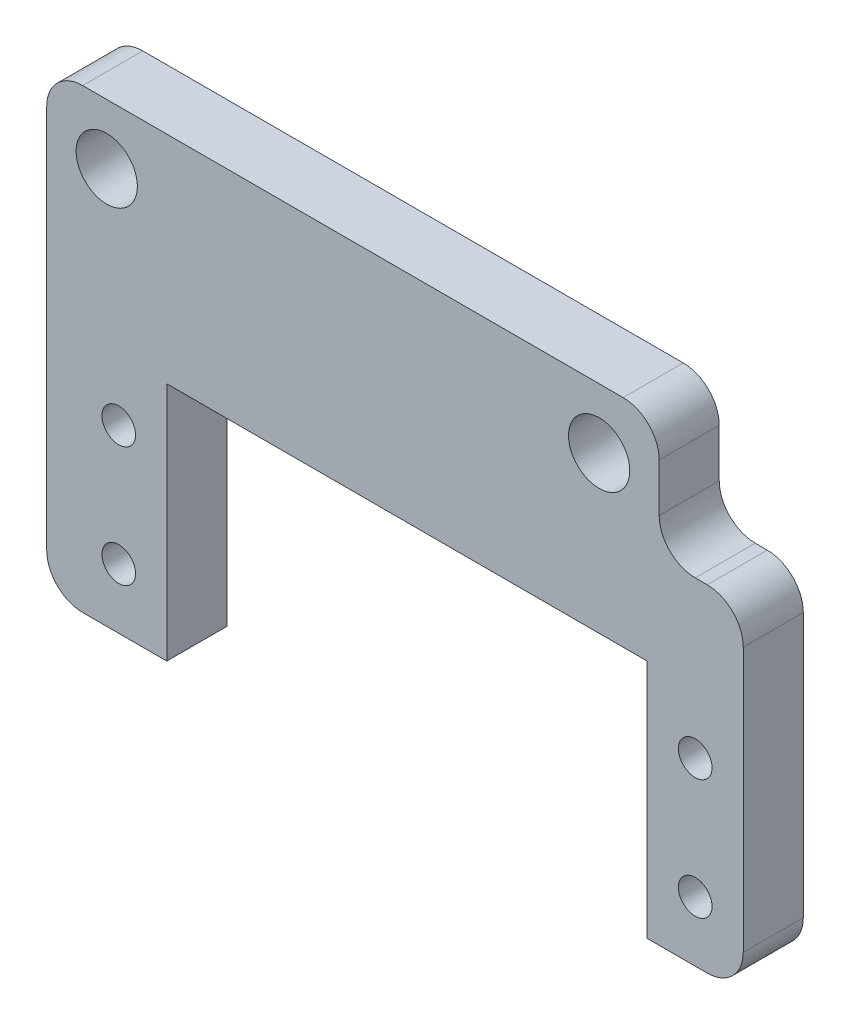
ISO-10303-21;
HEADER;
FILE_DESCRIPTION(('STEP AP214'),'2;1');
FILE_NAME('part.step','',(''),(''),'','','');
FILE_SCHEMA(('AUTOMOTIVE_DESIGN { 1 0 10303 214 1 1 1 1 }'));
ENDSEC;
DATA;
#1=APPLICATION_CONTEXT('core data for automotive mechanical design processes');
#2=APPLICATION_PROTOCOL_DEFINITION('international standard','automotive_design',2000,#1);
#3=PRODUCT_CONTEXT('',#1,'mechanical');
#4=PRODUCT('Part','Part','',(#3));
#5=PRODUCT_RELATED_PRODUCT_CATEGORY('part','',(#4));
#6=PRODUCT_DEFINITION_FORMATION('','',#4);
#7=PRODUCT_DEFINITION_CONTEXT('part definition',#1,'design');
#8=PRODUCT_DEFINITION('design','',#6,#7);
#9=PRODUCT_DEFINITION_SHAPE('','',#8);
#10=(LENGTH_UNIT() NAMED_UNIT(*) SI_UNIT(.MILLI.,.METRE.));
#11=(NAMED_UNIT(*) PLANE_ANGLE_UNIT() SI_UNIT($,.RADIAN.));
#12=(NAMED_UNIT(*) SI_UNIT($,.STERADIAN.) SOLID_ANGLE_UNIT());
#13=UNCERTAINTY_MEASURE_WITH_UNIT(LENGTH_MEASURE(1.E-05),#10,'distance_accuracy_value','');
#14=(GEOMETRIC_REPRESENTATION_CONTEXT(3) GLOBAL_UNCERTAINTY_ASSIGNED_CONTEXT((#13)) GLOBAL_UNIT_ASSIGNED_CONTEXT((#10,
#11,#12)) REPRESENTATION_CONTEXT('',''));
#15=CARTESIAN_POINT('',(0.,0.,0.));
#16=DIRECTION('',(0.,0.,1.));
#17=DIRECTION('',(1.,0.,0.));
#18=AXIS2_PLACEMENT_3D('',#15,#16,#17);
#19=CARTESIAN_POINT('',(0.,0.,5.));
#20=DIRECTION('',(0.,0.,-1.));
#21=DIRECTION('',(-1.,0.,0.));
#22=AXIS2_PLACEMENT_3D('',#19,#20,#21);
#23=PLANE('',#22);
#24=DIRECTION('',(0.,-1.,0.));
#25=VECTOR('',#24,1.);
#26=CARTESIAN_POINT('',(0.,0.,5.));
#27=LINE('',#26,#25);
#28=CARTESIAN_POINT('',(0.,7.,5.));
#29=VERTEX_POINT('',#28);
#30=CARTESIAN_POINT('',(0.,-25.,5.));
#31=VERTEX_POINT('',#30);
#32=EDGE_CURVE('E225',#29,#31,#27,.T.);
#33=ORIENTED_EDGE('',*,*,#32,.T.);
#34=CARTESIAN_POINT('',(3.,-25.,5.));
#35=DIRECTION('',(0.,0.,-1.));
#36=DIRECTION('',(-1.,0.,0.));
#37=AXIS2_PLACEMENT_3D('',#34,#35,#36);
#38=CIRCLE('',#37,3.);
#39=CARTESIAN_POINT('',(3.,-28.,5.));
#40=VERTEX_POINT('',#39);
#41=EDGE_CURVE('E256',#31,#40,#38,.F.);
#42=ORIENTED_EDGE('',*,*,#41,.T.);
#43=DIRECTION('',(1.,0.,0.));
#44=VECTOR('',#43,1.);
#45=CARTESIAN_POINT('',(10.,-28.,5.));
#46=LINE('',#45,#44);
#47=CARTESIAN_POINT('',(10.,-28.,5.));
#48=VERTEX_POINT('',#47);
#49=EDGE_CURVE('E189',#40,#48,#46,.T.);
#50=ORIENTED_EDGE('',*,*,#49,.T.);
#51=DIRECTION('',(0.,1.,0.));
#52=VECTOR('',#51,1.);
#53=CARTESIAN_POINT('',(10.,-28.,5.));
#54=LINE('',#53,#52);
#55=CARTESIAN_POINT('',(10.,-8.,5.));
#56=VERTEX_POINT('',#55);
#57=EDGE_CURVE('E166',#48,#56,#54,.T.);
#58=ORIENTED_EDGE('',*,*,#57,.T.);
#59=DIRECTION('',(1.,0.,0.));
#60=VECTOR('',#59,1.);
#61=CARTESIAN_POINT('',(10.,-8.,5.));
#62=LINE('',#61,#60);
#63=CARTESIAN_POINT('',(50.,-8.,5.));
#64=VERTEX_POINT('',#63);
#65=EDGE_CURVE('E193',#56,#64,#62,.T.);
#66=ORIENTED_EDGE('',*,*,#65,.T.);
#67=DIRECTION('',(0.,-1.,0.));
#68=VECTOR('',#67,1.);
#69=CARTESIAN_POINT('',(50.,-28.,5.));
#70=LINE('',#69,#68);
#71=CARTESIAN_POINT('',(50.,-28.,5.));
#72=VERTEX_POINT('',#71);
#73=EDGE_CURVE('E196',#64,#72,#70,.T.);
#74=ORIENTED_EDGE('',*,*,#73,.T.);
#75=DIRECTION('',(1.,0.,0.));
#76=VECTOR('',#75,1.);
#77=CARTESIAN_POINT('',(58.,-28.,5.));
#78=LINE('',#77,#76);
#79=CARTESIAN_POINT('',(55.,-28.,5.));
#80=VERTEX_POINT('',#79);
#81=EDGE_CURVE('E199',#72,#80,#78,.T.);
#82=ORIENTED_EDGE('',*,*,#81,.T.);
#83=CARTESIAN_POINT('',(55.,-25.,5.));
#84=DIRECTION('',(0.,0.,-1.));
#85=DIRECTION('',(-1.,0.,0.));
#86=AXIS2_PLACEMENT_3D('',#83,#84,#85);
#87=CIRCLE('',#86,3.);
#88=CARTESIAN_POINT('',(58.,-25.,5.));
#89=VERTEX_POINT('',#88);
#90=EDGE_CURVE('E254',#80,#89,#87,.F.);
#91=ORIENTED_EDGE('',*,*,#90,.T.);
#92=DIRECTION('',(0.,1.,0.));
#93=VECTOR('',#92,1.);
#94=CARTESIAN_POINT('',(58.,0.,5.));
#95=LINE('',#94,#93);
#96=CARTESIAN_POINT('',(58.,-3.,5.));
#97=VERTEX_POINT('',#96);
#98=EDGE_CURVE('E202',#89,#97,#95,.T.);
#99=ORIENTED_EDGE('',*,*,#98,.T.);
#100=CARTESIAN_POINT('',(55.,-3.,5.));
#101=DIRECTION('',(0.,0.,-1.));
#102=DIRECTION('',(-1.,0.,0.));
#103=AXIS2_PLACEMENT_3D('',#100,#101,#102);
#104=CIRCLE('',#103,3.);
#105=CARTESIAN_POINT('',(55.,0.,5.));
#106=VERTEX_POINT('',#105);
#107=EDGE_CURVE('E252',#97,#106,#104,.F.);
#108=ORIENTED_EDGE('',*,*,#107,.T.);
#109=DIRECTION('',(-1.,0.,0.));
#110=VECTOR('',#109,1.);
#111=CARTESIAN_POINT('',(0.,0.,5.));
#112=LINE('',#111,#110);
#113=CARTESIAN_POINT('',(54.,0.,5.));
#114=VERTEX_POINT('',#113);
#115=EDGE_CURVE('E160',#106,#114,#112,.T.);
#116=ORIENTED_EDGE('',*,*,#115,.T.);
#117=CARTESIAN_POINT('',(54.,3.,5.));
#118=DIRECTION('',(0.,0.,-1.));
#119=DIRECTION('',(-1.,0.,0.));
#120=AXIS2_PLACEMENT_3D('',#117,#118,#119);
#121=CIRCLE('',#120,3.);
#122=CARTESIAN_POINT('',(51.,3.,5.));
#123=VERTEX_POINT('',#122);
#124=EDGE_CURVE('E11',#114,#123,#121,.T.);
#125=ORIENTED_EDGE('',*,*,#124,.T.);
#126=DIRECTION('',(0.,1.,0.));
#127=VECTOR('',#126,1.);
#128=CARTESIAN_POINT('',(51.,0.,5.));
#129=LINE('',#128,#127);
#130=CARTESIAN_POINT('',(51.,7.,5.));
#131=VERTEX_POINT('',#130);
#132=EDGE_CURVE('E228',#123,#131,#129,.T.);
#133=ORIENTED_EDGE('',*,*,#132,.T.);
#134=CARTESIAN_POINT('',(48.,7.,5.));
#135=DIRECTION('',(0.,0.,-1.));
#136=DIRECTION('',(-1.,0.,0.));
#137=AXIS2_PLACEMENT_3D('',#134,#135,#136);
#138=CIRCLE('',#137,3.);
#139=CARTESIAN_POINT('',(48.,10.,5.));
#140=VERTEX_POINT('',#139);
#141=EDGE_CURVE('E248',#131,#140,#138,.F.);
#142=ORIENTED_EDGE('',*,*,#141,.T.);
#143=DIRECTION('',(-1.,0.,0.));
#144=VECTOR('',#143,1.);
#145=CARTESIAN_POINT('',(0.,10.,5.));
#146=LINE('',#145,#144);
#147=CARTESIAN_POINT('',(3.,10.,5.));
#148=VERTEX_POINT('',#147);
#149=EDGE_CURVE('E232',#140,#148,#146,.T.);
#150=ORIENTED_EDGE('',*,*,#149,.T.);
#151=CARTESIAN_POINT('',(3.,7.,5.));
#152=DIRECTION('',(0.,0.,-1.));
#153=DIRECTION('',(-1.,0.,0.));
#154=AXIS2_PLACEMENT_3D('',#151,#152,#153);
#155=CIRCLE('',#154,3.);
#156=EDGE_CURVE('E250',#148,#29,#155,.F.);
#157=ORIENTED_EDGE('',*,*,#156,.T.);
#158=EDGE_LOOP('',(#33,#42,#50,#58,#66,#74,#82,#91,#99,#108,#116,#125,#133,#142,#150,#157));
#159=FACE_BOUND('',#158,.T.);
#160=CARTESIAN_POINT('',(5.,5.,5.));
#161=DIRECTION('',(0.,0.,1.));
#162=DIRECTION('',(1.,0.,0.));
#163=AXIS2_PLACEMENT_3D('',#160,#161,#162);
#164=CIRCLE('',#163,2.55);
#165=CARTESIAN_POINT('',(7.55,5.,5.));
#166=VERTEX_POINT('',#165);
#167=EDGE_CURVE('E219',#166,#166,#164,.T.);
#168=ORIENTED_EDGE('',*,*,#167,.F.);
#169=EDGE_LOOP('',(#168));
#170=FACE_BOUND('',#169,.T.);
#171=CARTESIAN_POINT('',(46.,5.,5.));
#172=DIRECTION('',(0.,0.,1.));
#173=DIRECTION('',(1.,0.,0.));
#174=AXIS2_PLACEMENT_3D('',#171,#172,#173);
#175=CIRCLE('',#174,2.55);
#176=CARTESIAN_POINT('',(48.55,5.,5.));
#177=VERTEX_POINT('',#176);
#178=EDGE_CURVE('E213',#177,#177,#175,.T.);
#179=ORIENTED_EDGE('',*,*,#178,.F.);
#180=EDGE_LOOP('',(#179));
#181=FACE_BOUND('',#180,.T.);
#182=CARTESIAN_POINT('',(54.,-13.,5.));
#183=DIRECTION('',(0.,0.,1.));
#184=DIRECTION('',(-1.,0.,0.));
#185=AXIS2_PLACEMENT_3D('',#182,#183,#184);
#186=CIRCLE('',#185,1.4);
#187=CARTESIAN_POINT('',(52.6,-13.,5.));
#188=VERTEX_POINT('',#187);
#189=EDGE_CURVE('E563',#188,#188,#186,.T.);
#190=ORIENTED_EDGE('',*,*,#189,.F.);
#191=EDGE_LOOP('',(#190));
#192=FACE_BOUND('',#191,.T.);
#193=CARTESIAN_POINT('',(54.,-23.,5.));
#194=DIRECTION('',(0.,0.,1.));
#195=DIRECTION('',(-1.,0.,0.));
#196=AXIS2_PLACEMENT_3D('',#193,#194,#195);
#197=CIRCLE('',#196,1.4);
#198=CARTESIAN_POINT('',(52.6,-23.,5.));
#199=VERTEX_POINT('',#198);
#200=EDGE_CURVE('E566',#199,#199,#197,.T.);
#201=ORIENTED_EDGE('',*,*,#200,.F.);
#202=EDGE_LOOP('',(#201));
#203=FACE_BOUND('',#202,.T.);
#204=CARTESIAN_POINT('',(6.00000000000001,-13.,5.));
#205=DIRECTION('',(0.,0.,1.));
#206=DIRECTION('',(1.,0.,0.));
#207=AXIS2_PLACEMENT_3D('',#204,#205,#206);
#208=CIRCLE('',#207,1.4);
#209=CARTESIAN_POINT('',(7.40000000000001,-13.,5.));
#210=VERTEX_POINT('',#209);
#211=EDGE_CURVE('E572',#210,#210,#208,.T.);
#212=ORIENTED_EDGE('',*,*,#211,.F.);
#213=EDGE_LOOP('',(#212));
#214=FACE_BOUND('',#213,.T.);
#215=CARTESIAN_POINT('',(6.00000000000001,-23.,5.));
#216=DIRECTION('',(0.,0.,1.));
#217=DIRECTION('',(1.,0.,0.));
#218=AXIS2_PLACEMENT_3D('',#215,#216,#217);
#219=CIRCLE('',#218,1.4);
#220=CARTESIAN_POINT('',(7.40000000000001,-23.,5.));
#221=VERTEX_POINT('',#220);
#222=EDGE_CURVE('E578',#221,#221,#219,.T.);
#223=ORIENTED_EDGE('',*,*,#222,.F.);
#224=EDGE_LOOP('',(#223));
#225=FACE_BOUND('',#224,.T.);
#226=ADVANCED_FACE('F35',(#159,#170,#181,#192,#203,#214,#225),#23,.F.);
#227=CARTESIAN_POINT('',(0.,0.,0.));
#228=DIRECTION('',(0.,0.,-1.));
#229=DIRECTION('',(-1.,0.,0.));
#230=AXIS2_PLACEMENT_3D('',#227,#228,#229);
#231=PLANE('',#230);
#232=CARTESIAN_POINT('',(5.,5.,0.));
#233=DIRECTION('',(0.,0.,1.));
#234=DIRECTION('',(1.,0.,0.));
#235=AXIS2_PLACEMENT_3D('',#232,#233,#234);
#236=CIRCLE('',#235,2.55);
#237=CARTESIAN_POINT('',(7.55,5.,0.));
#238=VERTEX_POINT('',#237);
#239=EDGE_CURVE('E216',#238,#238,#236,.T.);
#240=ORIENTED_EDGE('',*,*,#239,.T.);
#241=EDGE_LOOP('',(#240));
#242=FACE_BOUND('',#241,.T.);
#243=DIRECTION('',(1.,0.,0.));
#244=VECTOR('',#243,1.);
#245=CARTESIAN_POINT('',(10.,-28.,0.));
#246=LINE('',#245,#244);
#247=CARTESIAN_POINT('',(3.,-28.,0.));
#248=VERTEX_POINT('',#247);
#249=CARTESIAN_POINT('',(10.,-28.,0.));
#250=VERTEX_POINT('',#249);
#251=EDGE_CURVE('E149',#248,#250,#246,.T.);
#252=ORIENTED_EDGE('',*,*,#251,.F.);
#253=CARTESIAN_POINT('',(3.,-25.,0.));
#254=DIRECTION('',(0.,0.,-1.));
#255=DIRECTION('',(-1.,0.,0.));
#256=AXIS2_PLACEMENT_3D('',#253,#254,#255);
#257=CIRCLE('',#256,3.);
#258=CARTESIAN_POINT('',(0.,-25.,0.));
#259=VERTEX_POINT('',#258);
#260=EDGE_CURVE('E265',#248,#259,#257,.T.);
#261=ORIENTED_EDGE('',*,*,#260,.T.);
#262=DIRECTION('',(0.,-1.,0.));
#263=VECTOR('',#262,1.);
#264=CARTESIAN_POINT('',(0.,0.,0.));
#265=LINE('',#264,#263);
#266=CARTESIAN_POINT('',(0.,7.,0.));
#267=VERTEX_POINT('',#266);
#268=EDGE_CURVE('E222',#267,#259,#265,.T.);
#269=ORIENTED_EDGE('',*,*,#268,.F.);
#270=CARTESIAN_POINT('',(3.,7.,0.));
#271=DIRECTION('',(0.,0.,-1.));
#272=DIRECTION('',(-1.,0.,0.));
#273=AXIS2_PLACEMENT_3D('',#270,#271,#272);
#274=CIRCLE('',#273,3.);
#275=CARTESIAN_POINT('',(3.,10.,0.));
#276=VERTEX_POINT('',#275);
#277=EDGE_CURVE('E261',#267,#276,#274,.T.);
#278=ORIENTED_EDGE('',*,*,#277,.T.);
#279=DIRECTION('',(-1.,0.,0.));
#280=VECTOR('',#279,1.);
#281=CARTESIAN_POINT('',(0.,10.,0.));
#282=LINE('',#281,#280);
#283=CARTESIAN_POINT('',(48.,10.,0.));
#284=VERTEX_POINT('',#283);
#285=EDGE_CURVE('E229',#284,#276,#282,.T.);
#286=ORIENTED_EDGE('',*,*,#285,.F.);
#287=CARTESIAN_POINT('',(48.,7.,0.));
#288=DIRECTION('',(0.,0.,-1.));
#289=DIRECTION('',(-1.,0.,0.));
#290=AXIS2_PLACEMENT_3D('',#287,#288,#289);
#291=CIRCLE('',#290,3.);
#292=CARTESIAN_POINT('',(51.,7.,0.));
#293=VERTEX_POINT('',#292);
#294=EDGE_CURVE('E259',#284,#293,#291,.T.);
#295=ORIENTED_EDGE('',*,*,#294,.T.);
#296=DIRECTION('',(0.,1.,0.));
#297=VECTOR('',#296,1.);
#298=CARTESIAN_POINT('',(51.,0.,0.));
#299=LINE('',#298,#297);
#300=CARTESIAN_POINT('',(51.,3.,0.));
#301=VERTEX_POINT('',#300);
#302=EDGE_CURVE('E238',#301,#293,#299,.T.);
#303=ORIENTED_EDGE('',*,*,#302,.F.);
#304=CARTESIAN_POINT('',(54.,3.,0.));
#305=DIRECTION('',(0.,0.,-1.));
#306=DIRECTION('',(-1.,0.,0.));
#307=AXIS2_PLACEMENT_3D('',#304,#305,#306);
#308=CIRCLE('',#307,3.);
#309=CARTESIAN_POINT('',(54.,0.,0.));
#310=VERTEX_POINT('',#309);
#311=EDGE_CURVE('E43',#301,#310,#308,.F.);
#312=ORIENTED_EDGE('',*,*,#311,.T.);
#313=DIRECTION('',(-1.,0.,0.));
#314=VECTOR('',#313,1.);
#315=CARTESIAN_POINT('',(51.,0.,0.));
#316=LINE('',#315,#314);
#317=CARTESIAN_POINT('',(55.,0.,0.));
#318=VERTEX_POINT('',#317);
#319=EDGE_CURVE('E168',#318,#310,#316,.T.);
#320=ORIENTED_EDGE('',*,*,#319,.F.);
#321=CARTESIAN_POINT('',(55.,-3.,0.));
#322=DIRECTION('',(0.,0.,-1.));
#323=DIRECTION('',(-1.,0.,0.));
#324=AXIS2_PLACEMENT_3D('',#321,#322,#323);
#325=CIRCLE('',#324,3.);
#326=CARTESIAN_POINT('',(58.,-3.,0.));
#327=VERTEX_POINT('',#326);
#328=EDGE_CURVE('E56',#318,#327,#325,.T.);
#329=ORIENTED_EDGE('',*,*,#328,.T.);
#330=DIRECTION('',(0.,1.,0.));
#331=VECTOR('',#330,1.);
#332=CARTESIAN_POINT('',(58.,0.,0.));
#333=LINE('',#332,#331);
#334=CARTESIAN_POINT('',(58.,-25.,0.));
#335=VERTEX_POINT('',#334);
#336=EDGE_CURVE('E185',#335,#327,#333,.T.);
#337=ORIENTED_EDGE('',*,*,#336,.F.);
#338=CARTESIAN_POINT('',(55.,-25.,0.));
#339=DIRECTION('',(0.,0.,-1.));
#340=DIRECTION('',(-1.,0.,0.));
#341=AXIS2_PLACEMENT_3D('',#338,#339,#340);
#342=CIRCLE('',#341,3.);
#343=CARTESIAN_POINT('',(55.,-28.,0.));
#344=VERTEX_POINT('',#343);
#345=EDGE_CURVE('E50',#335,#344,#342,.T.);
#346=ORIENTED_EDGE('',*,*,#345,.T.);
#347=DIRECTION('',(1.,0.,0.));
#348=VECTOR('',#347,1.);
#349=CARTESIAN_POINT('',(58.,-28.,0.));
#350=LINE('',#349,#348);
#351=CARTESIAN_POINT('',(50.,-28.,0.));
#352=VERTEX_POINT('',#351);
#353=EDGE_CURVE('E183',#352,#344,#350,.T.);
#354=ORIENTED_EDGE('',*,*,#353,.F.);
#355=DIRECTION('',(0.,-1.,0.));
#356=VECTOR('',#355,1.);
#357=CARTESIAN_POINT('',(50.,-28.,0.));
#358=LINE('',#357,#356);
#359=CARTESIAN_POINT('',(50.,-8.,0.));
#360=VERTEX_POINT('',#359);
#361=EDGE_CURVE('E177',#360,#352,#358,.T.);
#362=ORIENTED_EDGE('',*,*,#361,.F.);
#363=DIRECTION('',(1.,0.,0.));
#364=VECTOR('',#363,1.);
#365=CARTESIAN_POINT('',(10.,-8.,0.));
#366=LINE('',#365,#364);
#367=CARTESIAN_POINT('',(10.,-8.,0.));
#368=VERTEX_POINT('',#367);
#369=EDGE_CURVE('E175',#368,#360,#366,.T.);
#370=ORIENTED_EDGE('',*,*,#369,.F.);
#371=DIRECTION('',(0.,1.,0.));
#372=VECTOR('',#371,1.);
#373=CARTESIAN_POINT('',(10.,-28.,0.));
#374=LINE('',#373,#372);
#375=EDGE_CURVE('E159',#250,#368,#374,.T.);
#376=ORIENTED_EDGE('',*,*,#375,.F.);
#377=EDGE_LOOP('',(#252,#261,#269,#278,#286,#295,#303,#312,#320,#329,#337,#346,#354,#362,#370,#376));
#378=FACE_BOUND('',#377,.T.);
#379=CARTESIAN_POINT('',(46.,5.,0.));
#380=DIRECTION('',(0.,0.,1.));
#381=DIRECTION('',(1.,0.,0.));
#382=AXIS2_PLACEMENT_3D('',#379,#380,#381);
#383=CIRCLE('',#382,2.55);
#384=CARTESIAN_POINT('',(48.55,5.,0.));
#385=VERTEX_POINT('',#384);
#386=EDGE_CURVE('E209',#385,#385,#383,.T.);
#387=ORIENTED_EDGE('',*,*,#386,.T.);
#388=EDGE_LOOP('',(#387));
#389=FACE_BOUND('',#388,.T.);
#390=CARTESIAN_POINT('',(54.,-13.,0.));
#391=DIRECTION('',(0.,0.,1.));
#392=DIRECTION('',(-1.,0.,0.));
#393=AXIS2_PLACEMENT_3D('',#390,#391,#392);
#394=CIRCLE('',#393,1.4);
#395=CARTESIAN_POINT('',(52.6,-13.,0.));
#396=VERTEX_POINT('',#395);
#397=EDGE_CURVE('E560',#396,#396,#394,.T.);
#398=ORIENTED_EDGE('',*,*,#397,.T.);
#399=EDGE_LOOP('',(#398));
#400=FACE_BOUND('',#399,.T.);
#401=CARTESIAN_POINT('',(54.,-23.,0.));
#402=DIRECTION('',(0.,0.,1.));
#403=DIRECTION('',(-1.,0.,0.));
#404=AXIS2_PLACEMENT_3D('',#401,#402,#403);
#405=CIRCLE('',#404,1.4);
#406=CARTESIAN_POINT('',(52.6,-23.,0.));
#407=VERTEX_POINT('',#406);
#408=EDGE_CURVE('E569',#407,#407,#405,.T.);
#409=ORIENTED_EDGE('',*,*,#408,.T.);
#410=EDGE_LOOP('',(#409));
#411=FACE_BOUND('',#410,.T.);
#412=CARTESIAN_POINT('',(6.00000000000001,-13.,0.));
#413=DIRECTION('',(0.,0.,1.));
#414=DIRECTION('',(1.,0.,0.));
#415=AXIS2_PLACEMENT_3D('',#412,#413,#414);
#416=CIRCLE('',#415,1.4);
#417=CARTESIAN_POINT('',(7.40000000000001,-13.,0.));
#418=VERTEX_POINT('',#417);
#419=EDGE_CURVE('E575',#418,#418,#416,.T.);
#420=ORIENTED_EDGE('',*,*,#419,.T.);
#421=EDGE_LOOP('',(#420));
#422=FACE_BOUND('',#421,.T.);
#423=CARTESIAN_POINT('',(6.00000000000001,-23.,0.));
#424=DIRECTION('',(0.,0.,1.));
#425=DIRECTION('',(1.,0.,0.));
#426=AXIS2_PLACEMENT_3D('',#423,#424,#425);
#427=CIRCLE('',#426,1.4);
#428=CARTESIAN_POINT('',(7.40000000000001,-23.,0.));
#429=VERTEX_POINT('',#428);
#430=EDGE_CURVE('E191',#429,#429,#427,.T.);
#431=ORIENTED_EDGE('',*,*,#430,.T.);
#432=EDGE_LOOP('',(#431));
#433=FACE_BOUND('',#432,.T.);
#434=ADVANCED_FACE('F171',(#242,#378,#389,#400,#411,#422,#433),#231,.T.);
#435=CARTESIAN_POINT('',(0.,0.,5.));
#436=DIRECTION('',(1.,0.,0.));
#437=DIRECTION('',(0.,0.,-1.));
#438=AXIS2_PLACEMENT_3D('',#435,#436,#437);
#439=PLANE('',#438);
#440=ORIENTED_EDGE('',*,*,#268,.T.);
#441=DIRECTION('',(0.,0.,1.));
#442=VECTOR('',#441,1.);
#443=CARTESIAN_POINT('',(0.,-25.,5.));
#444=LINE('',#443,#442);
#445=EDGE_CURVE('E245',#259,#31,#444,.T.);
#446=ORIENTED_EDGE('',*,*,#445,.T.);
#447=ORIENTED_EDGE('',*,*,#32,.F.);
#448=DIRECTION('',(0.,0.,-1.));
#449=VECTOR('',#448,1.);
#450=CARTESIAN_POINT('',(0.,7.,5.));
#451=LINE('',#450,#449);
#452=EDGE_CURVE('E235',#29,#267,#451,.T.);
#453=ORIENTED_EDGE('',*,*,#452,.T.);
#454=EDGE_LOOP('',(#440,#446,#447,#453));
#455=FACE_BOUND('',#454,.T.);
#456=ADVANCED_FACE('F318',(#455),#439,.F.);
#457=CARTESIAN_POINT('',(51.,0.,5.));
#458=DIRECTION('',(-1.,0.,0.));
#459=DIRECTION('',(0.,0.,1.));
#460=AXIS2_PLACEMENT_3D('',#457,#458,#459);
#461=PLANE('',#460);
#462=ORIENTED_EDGE('',*,*,#302,.T.);
#463=DIRECTION('',(0.,0.,-1.));
#464=VECTOR('',#463,1.);
#465=CARTESIAN_POINT('',(51.,7.,5.));
#466=LINE('',#465,#464);
#467=EDGE_CURVE('E287',#293,#131,#466,.F.);
#468=ORIENTED_EDGE('',*,*,#467,.T.);
#469=ORIENTED_EDGE('',*,*,#132,.F.);
#470=DIRECTION('',(0.,0.,-1.));
#471=VECTOR('',#470,1.);
#472=CARTESIAN_POINT('',(51.,3.,5.));
#473=LINE('',#472,#471);
#474=EDGE_CURVE('E284',#123,#301,#473,.T.);
#475=ORIENTED_EDGE('',*,*,#474,.T.);
#476=EDGE_LOOP('',(#462,#468,#469,#475));
#477=FACE_BOUND('',#476,.T.);
#478=ADVANCED_FACE('F302',(#477),#461,.F.);
#479=CARTESIAN_POINT('',(0.,10.,5.));
#480=DIRECTION('',(0.,-1.,0.));
#481=DIRECTION('',(0.,0.,-1.));
#482=AXIS2_PLACEMENT_3D('',#479,#480,#481);
#483=PLANE('',#482);
#484=ORIENTED_EDGE('',*,*,#285,.T.);
#485=DIRECTION('',(0.,0.,-1.));
#486=VECTOR('',#485,1.);
#487=CARTESIAN_POINT('',(3.,10.,5.));
#488=LINE('',#487,#486);
#489=EDGE_CURVE('E282',#276,#148,#488,.F.);
#490=ORIENTED_EDGE('',*,*,#489,.T.);
#491=ORIENTED_EDGE('',*,*,#149,.F.);
#492=DIRECTION('',(0.,0.,-1.));
#493=VECTOR('',#492,1.);
#494=CARTESIAN_POINT('',(48.,10.,5.));
#495=LINE('',#494,#493);
#496=EDGE_CURVE('E279',#140,#284,#495,.T.);
#497=ORIENTED_EDGE('',*,*,#496,.T.);
#498=EDGE_LOOP('',(#484,#490,#491,#497));
#499=FACE_BOUND('',#498,.T.);
#500=ADVANCED_FACE('F310',(#499),#483,.F.);
#501=CARTESIAN_POINT('',(5.,5.,5.));
#502=DIRECTION('',(0.,0.,-1.));
#503=DIRECTION('',(-1.,0.,0.));
#504=AXIS2_PLACEMENT_3D('',#501,#502,#503);
#505=CYLINDRICAL_SURFACE('',#504,2.55);
#506=ORIENTED_EDGE('',*,*,#167,.T.);
#507=EDGE_LOOP('',(#506));
#508=FACE_BOUND('',#507,.T.);
#509=ORIENTED_EDGE('',*,*,#239,.F.);
#510=EDGE_LOOP('',(#509));
#511=FACE_BOUND('',#510,.T.);
#512=ADVANCED_FACE('F359',(#508,#511),#505,.F.);
#513=CARTESIAN_POINT('',(46.,5.,5.));
#514=DIRECTION('',(0.,0.,-1.));
#515=DIRECTION('',(-1.,0.,0.));
#516=AXIS2_PLACEMENT_3D('',#513,#514,#515);
#517=CYLINDRICAL_SURFACE('',#516,2.55);
#518=ORIENTED_EDGE('',*,*,#178,.T.);
#519=EDGE_LOOP('',(#518));
#520=FACE_BOUND('',#519,.T.);
#521=ORIENTED_EDGE('',*,*,#386,.F.);
#522=EDGE_LOOP('',(#521));
#523=FACE_BOUND('',#522,.T.);
#524=ADVANCED_FACE('F386',(#520,#523),#517,.F.);
#525=CARTESIAN_POINT('',(0.,0.,0.));
#526=DIRECTION('',(0.,1.,0.));
#527=DIRECTION('',(0.,0.,1.));
#528=AXIS2_PLACEMENT_3D('',#525,#526,#527);
#529=PLANE('',#528);
#530=ORIENTED_EDGE('',*,*,#115,.F.);
#531=DIRECTION('',(0.,0.,1.));
#532=VECTOR('',#531,1.);
#533=CARTESIAN_POINT('',(55.,0.,0.));
#534=LINE('',#533,#532);
#535=EDGE_CURVE('E277',#106,#318,#534,.F.);
#536=ORIENTED_EDGE('',*,*,#535,.T.);
#537=ORIENTED_EDGE('',*,*,#319,.T.);
#538=DIRECTION('',(0.,0.,-1.));
#539=VECTOR('',#538,1.);
#540=CARTESIAN_POINT('',(54.,0.,0.));
#541=LINE('',#540,#539);
#542=EDGE_CURVE('E275',#310,#114,#541,.F.);
#543=ORIENTED_EDGE('',*,*,#542,.T.);
#544=EDGE_LOOP('',(#530,#536,#537,#543));
#545=FACE_BOUND('',#544,.T.);
#546=ADVANCED_FACE('F294',(#545),#529,.T.);
#547=CARTESIAN_POINT('',(10.,-28.,0.));
#548=DIRECTION('',(0.,-1.,0.));
#549=DIRECTION('',(0.,0.,-1.));
#550=AXIS2_PLACEMENT_3D('',#547,#548,#549);
#551=PLANE('',#550);
#552=ORIENTED_EDGE('',*,*,#49,.F.);
#553=DIRECTION('',(0.,0.,1.));
#554=VECTOR('',#553,1.);
#555=CARTESIAN_POINT('',(3.,-28.,0.));
#556=LINE('',#555,#554);
#557=EDGE_CURVE('E156',#40,#248,#556,.F.);
#558=ORIENTED_EDGE('',*,*,#557,.T.);
#559=ORIENTED_EDGE('',*,*,#251,.T.);
#560=DIRECTION('',(0.,0.,1.));
#561=VECTOR('',#560,1.);
#562=CARTESIAN_POINT('',(10.,-28.,0.));
#563=LINE('',#562,#561);
#564=EDGE_CURVE('E153',#250,#48,#563,.T.);
#565=ORIENTED_EDGE('',*,*,#564,.T.);
#566=EDGE_LOOP('',(#552,#558,#559,#565));
#567=FACE_BOUND('',#566,.T.);
#568=ADVANCED_FACE('F152',(#567),#551,.T.);
#569=CARTESIAN_POINT('',(58.,0.,0.));
#570=DIRECTION('',(1.,0.,0.));
#571=DIRECTION('',(0.,1.,0.));
#572=AXIS2_PLACEMENT_3D('',#569,#570,#571);
#573=PLANE('',#572);
#574=ORIENTED_EDGE('',*,*,#98,.F.);
#575=DIRECTION('',(0.,0.,1.));
#576=VECTOR('',#575,1.);
#577=CARTESIAN_POINT('',(58.,-25.,0.));
#578=LINE('',#577,#576);
#579=EDGE_CURVE('E273',#89,#335,#578,.F.);
#580=ORIENTED_EDGE('',*,*,#579,.T.);
#581=ORIENTED_EDGE('',*,*,#336,.T.);
#582=DIRECTION('',(0.,0.,1.));
#583=VECTOR('',#582,1.);
#584=CARTESIAN_POINT('',(58.,-3.,0.));
#585=LINE('',#584,#583);
#586=EDGE_CURVE('E270',#327,#97,#585,.T.);
#587=ORIENTED_EDGE('',*,*,#586,.T.);
#588=EDGE_LOOP('',(#574,#580,#581,#587));
#589=FACE_BOUND('',#588,.T.);
#590=ADVANCED_FACE('F337',(#589),#573,.T.);
#591=CARTESIAN_POINT('',(58.,-28.,0.));
#592=DIRECTION('',(0.,-1.,0.));
#593=DIRECTION('',(0.,0.,-1.));
#594=AXIS2_PLACEMENT_3D('',#591,#592,#593);
#595=PLANE('',#594);
#596=ORIENTED_EDGE('',*,*,#353,.T.);
#597=DIRECTION('',(0.,0.,1.));
#598=VECTOR('',#597,1.);
#599=CARTESIAN_POINT('',(55.,-28.,0.));
#600=LINE('',#599,#598);
#601=EDGE_CURVE('E267',#344,#80,#600,.T.);
#602=ORIENTED_EDGE('',*,*,#601,.T.);
#603=ORIENTED_EDGE('',*,*,#81,.F.);
#604=DIRECTION('',(0.,0.,1.));
#605=VECTOR('',#604,1.);
#606=CARTESIAN_POINT('',(50.,-28.,0.));
#607=LINE('',#606,#605);
#608=EDGE_CURVE('E207',#352,#72,#607,.T.);
#609=ORIENTED_EDGE('',*,*,#608,.F.);
#610=EDGE_LOOP('',(#596,#602,#603,#609));
#611=FACE_BOUND('',#610,.T.);
#612=ADVANCED_FACE('F331',(#611),#595,.T.);
#613=CARTESIAN_POINT('',(50.,-28.,0.));
#614=DIRECTION('',(-1.,0.,0.));
#615=DIRECTION('',(0.,-1.,0.));
#616=AXIS2_PLACEMENT_3D('',#613,#614,#615);
#617=PLANE('',#616);
#618=ORIENTED_EDGE('',*,*,#73,.F.);
#619=DIRECTION('',(0.,0.,1.));
#620=VECTOR('',#619,1.);
#621=CARTESIAN_POINT('',(50.,-8.,0.));
#622=LINE('',#621,#620);
#623=EDGE_CURVE('E210',#360,#64,#622,.T.);
#624=ORIENTED_EDGE('',*,*,#623,.F.);
#625=ORIENTED_EDGE('',*,*,#361,.T.);
#626=ORIENTED_EDGE('',*,*,#608,.T.);
#627=EDGE_LOOP('',(#618,#624,#625,#626));
#628=FACE_BOUND('',#627,.T.);
#629=ADVANCED_FACE('F328',(#628),#617,.T.);
#630=CARTESIAN_POINT('',(10.,-8.,0.));
#631=DIRECTION('',(0.,-1.,0.));
#632=DIRECTION('',(0.,0.,-1.));
#633=AXIS2_PLACEMENT_3D('',#630,#631,#632);
#634=PLANE('',#633);
#635=ORIENTED_EDGE('',*,*,#65,.F.);
#636=DIRECTION('',(0.,0.,1.));
#637=VECTOR('',#636,1.);
#638=CARTESIAN_POINT('',(10.,-8.,0.));
#639=LINE('',#638,#637);
#640=EDGE_CURVE('E167',#368,#56,#639,.T.);
#641=ORIENTED_EDGE('',*,*,#640,.F.);
#642=ORIENTED_EDGE('',*,*,#369,.T.);
#643=ORIENTED_EDGE('',*,*,#623,.T.);
#644=EDGE_LOOP('',(#635,#641,#642,#643));
#645=FACE_BOUND('',#644,.T.);
#646=ADVANCED_FACE('F326',(#645),#634,.T.);
#647=CARTESIAN_POINT('',(10.,-28.,0.));
#648=DIRECTION('',(1.,0.,0.));
#649=DIRECTION('',(0.,1.,0.));
#650=AXIS2_PLACEMENT_3D('',#647,#648,#649);
#651=PLANE('',#650);
#652=ORIENTED_EDGE('',*,*,#57,.F.);
#653=ORIENTED_EDGE('',*,*,#564,.F.);
#654=ORIENTED_EDGE('',*,*,#375,.T.);
#655=ORIENTED_EDGE('',*,*,#640,.T.);
#656=EDGE_LOOP('',(#652,#653,#654,#655));
#657=FACE_BOUND('',#656,.T.);
#658=ADVANCED_FACE('F164',(#657),#651,.T.);
#659=CARTESIAN_POINT('',(6.00000000000001,-23.,0.));
#660=DIRECTION('',(0.,0.,1.));
#661=DIRECTION('',(1.,0.,0.));
#662=AXIS2_PLACEMENT_3D('',#659,#660,#661);
#663=CYLINDRICAL_SURFACE('',#662,1.4);
#664=ORIENTED_EDGE('',*,*,#430,.F.);
#665=EDGE_LOOP('',(#664));
#666=FACE_BOUND('',#665,.T.);
#667=ORIENTED_EDGE('',*,*,#222,.T.);
#668=EDGE_LOOP('',(#667));
#669=FACE_BOUND('',#668,.T.);
#670=ADVANCED_FACE('F435',(#666,#669),#663,.F.);
#671=CARTESIAN_POINT('',(6.00000000000001,-13.,0.));
#672=DIRECTION('',(0.,0.,1.));
#673=DIRECTION('',(1.,0.,0.));
#674=AXIS2_PLACEMENT_3D('',#671,#672,#673);
#675=CYLINDRICAL_SURFACE('',#674,1.4);
#676=ORIENTED_EDGE('',*,*,#419,.F.);
#677=EDGE_LOOP('',(#676));
#678=FACE_BOUND('',#677,.T.);
#679=ORIENTED_EDGE('',*,*,#211,.T.);
#680=EDGE_LOOP('',(#679));
#681=FACE_BOUND('',#680,.T.);
#682=ADVANCED_FACE('F442',(#678,#681),#675,.F.);
#683=CARTESIAN_POINT('',(54.,-23.,0.));
#684=DIRECTION('',(0.,0.,1.));
#685=DIRECTION('',(1.,0.,0.));
#686=AXIS2_PLACEMENT_3D('',#683,#684,#685);
#687=CYLINDRICAL_SURFACE('',#686,1.4);
#688=ORIENTED_EDGE('',*,*,#408,.F.);
#689=EDGE_LOOP('',(#688));
#690=FACE_BOUND('',#689,.T.);
#691=ORIENTED_EDGE('',*,*,#200,.T.);
#692=EDGE_LOOP('',(#691));
#693=FACE_BOUND('',#692,.T.);
#694=ADVANCED_FACE('F450',(#690,#693),#687,.F.);
#695=CARTESIAN_POINT('',(54.,-13.,0.));
#696=DIRECTION('',(0.,0.,1.));
#697=DIRECTION('',(1.,0.,0.));
#698=AXIS2_PLACEMENT_3D('',#695,#696,#697);
#699=CYLINDRICAL_SURFACE('',#698,1.4);
#700=ORIENTED_EDGE('',*,*,#397,.F.);
#701=EDGE_LOOP('',(#700));
#702=FACE_BOUND('',#701,.T.);
#703=ORIENTED_EDGE('',*,*,#189,.T.);
#704=EDGE_LOOP('',(#703));
#705=FACE_BOUND('',#704,.T.);
#706=ADVANCED_FACE('F349',(#702,#705),#699,.F.);
#707=CARTESIAN_POINT('',(3.,-25.,5.));
#708=DIRECTION('',(0.,0.,-1.));
#709=DIRECTION('',(-1.,0.,0.));
#710=AXIS2_PLACEMENT_3D('',#707,#708,#709);
#711=CYLINDRICAL_SURFACE('',#710,3.);
#712=ORIENTED_EDGE('',*,*,#260,.F.);
#713=ORIENTED_EDGE('',*,*,#557,.F.);
#714=ORIENTED_EDGE('',*,*,#41,.F.);
#715=ORIENTED_EDGE('',*,*,#445,.F.);
#716=EDGE_LOOP('',(#712,#713,#714,#715));
#717=FACE_BOUND('',#716,.T.);
#718=ADVANCED_FACE('F322',(#717),#711,.T.);
#719=CARTESIAN_POINT('',(55.,-25.,0.));
#720=DIRECTION('',(0.,0.,1.));
#721=DIRECTION('',(1.,0.,0.));
#722=AXIS2_PLACEMENT_3D('',#719,#720,#721);
#723=CYLINDRICAL_SURFACE('',#722,3.);
#724=ORIENTED_EDGE('',*,*,#345,.F.);
#725=ORIENTED_EDGE('',*,*,#579,.F.);
#726=ORIENTED_EDGE('',*,*,#90,.F.);
#727=ORIENTED_EDGE('',*,*,#601,.F.);
#728=EDGE_LOOP('',(#724,#725,#726,#727));
#729=FACE_BOUND('',#728,.T.);
#730=ADVANCED_FACE('F339',(#729),#723,.T.);
#731=CARTESIAN_POINT('',(55.,-3.,0.));
#732=DIRECTION('',(0.,0.,1.));
#733=DIRECTION('',(1.,0.,0.));
#734=AXIS2_PLACEMENT_3D('',#731,#732,#733);
#735=CYLINDRICAL_SURFACE('',#734,3.);
#736=ORIENTED_EDGE('',*,*,#328,.F.);
#737=ORIENTED_EDGE('',*,*,#535,.F.);
#738=ORIENTED_EDGE('',*,*,#107,.F.);
#739=ORIENTED_EDGE('',*,*,#586,.F.);
#740=EDGE_LOOP('',(#736,#737,#738,#739));
#741=FACE_BOUND('',#740,.T.);
#742=ADVANCED_FACE('F341',(#741),#735,.T.);
#743=CARTESIAN_POINT('',(3.,7.,5.));
#744=DIRECTION('',(0.,0.,-1.));
#745=DIRECTION('',(-1.,0.,0.));
#746=AXIS2_PLACEMENT_3D('',#743,#744,#745);
#747=CYLINDRICAL_SURFACE('',#746,3.);
#748=ORIENTED_EDGE('',*,*,#156,.F.);
#749=ORIENTED_EDGE('',*,*,#489,.F.);
#750=ORIENTED_EDGE('',*,*,#277,.F.);
#751=ORIENTED_EDGE('',*,*,#452,.F.);
#752=EDGE_LOOP('',(#748,#749,#750,#751));
#753=FACE_BOUND('',#752,.T.);
#754=ADVANCED_FACE('F314',(#753),#747,.T.);
#755=CARTESIAN_POINT('',(48.,7.,5.));
#756=DIRECTION('',(0.,0.,-1.));
#757=DIRECTION('',(-1.,0.,0.));
#758=AXIS2_PLACEMENT_3D('',#755,#756,#757);
#759=CYLINDRICAL_SURFACE('',#758,3.);
#760=ORIENTED_EDGE('',*,*,#141,.F.);
#761=ORIENTED_EDGE('',*,*,#467,.F.);
#762=ORIENTED_EDGE('',*,*,#294,.F.);
#763=ORIENTED_EDGE('',*,*,#496,.F.);
#764=EDGE_LOOP('',(#760,#761,#762,#763));
#765=FACE_BOUND('',#764,.T.);
#766=ADVANCED_FACE('F305',(#765),#759,.T.);
#767=CARTESIAN_POINT('',(54.,3.,5.));
#768=DIRECTION('',(0.,0.,-1.));
#769=DIRECTION('',(-1.,0.,0.));
#770=AXIS2_PLACEMENT_3D('',#767,#768,#769);
#771=CYLINDRICAL_SURFACE('',#770,3.);
#772=ORIENTED_EDGE('',*,*,#124,.F.);
#773=ORIENTED_EDGE('',*,*,#542,.F.);
#774=ORIENTED_EDGE('',*,*,#311,.F.);
#775=ORIENTED_EDGE('',*,*,#474,.F.);
#776=EDGE_LOOP('',(#772,#773,#774,#775));
#777=FACE_BOUND('',#776,.T.);
#778=ADVANCED_FACE('F37',(#777),#771,.F.);
#779=CLOSED_SHELL('',(#226,#434,#456,#478,#500,#512,#524,#546,#568,#590,#612,#629,#646,#658,
#670,#682,#694,#706,#718,#730,#742,#754,#766,#778));
#780=MANIFOLD_SOLID_BREP('B2',#779);
#781=ADVANCED_BREP_SHAPE_REPRESENTATION('',(#18,#780),#14);
#782=SHAPE_DEFINITION_REPRESENTATION(#9,#781);
ENDSEC;
END-ISO-10303-21;
